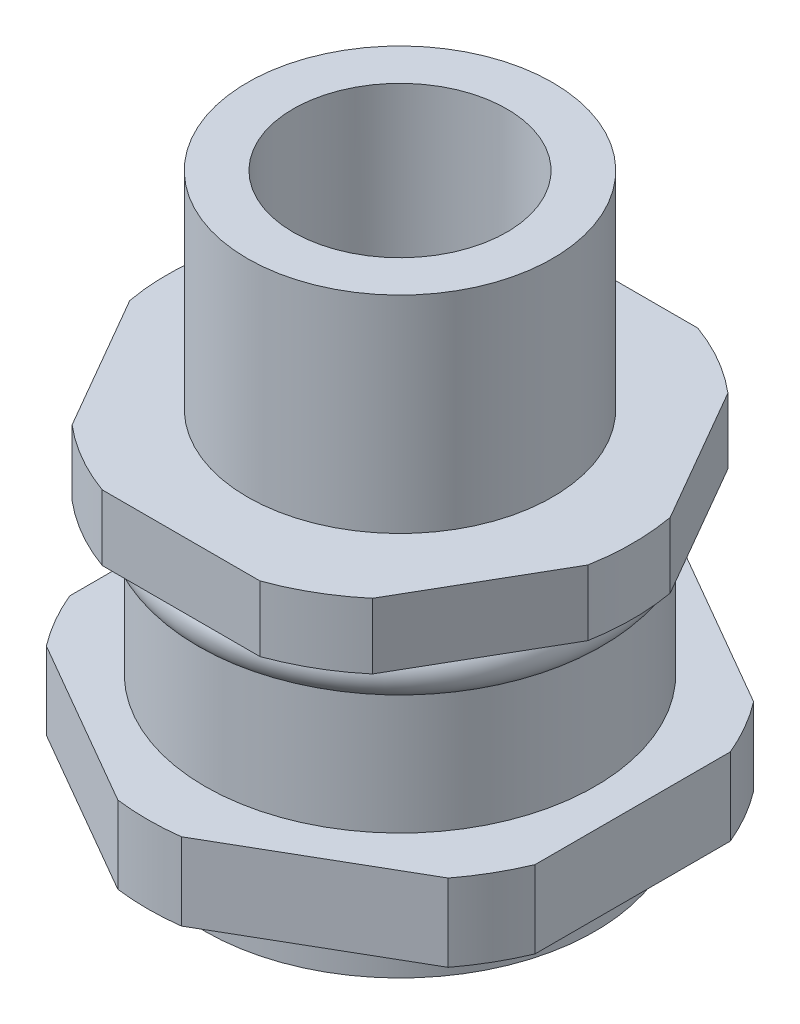
ISO-10303-21;
HEADER;
FILE_DESCRIPTION(('STEP AP214'),'2;1');
FILE_NAME('part.step','',(''),(''),'','','');
FILE_SCHEMA(('AUTOMOTIVE_DESIGN { 1 0 10303 214 1 1 1 1 }'));
ENDSEC;
DATA;
#1=APPLICATION_CONTEXT('core data for automotive mechanical design processes');
#2=APPLICATION_PROTOCOL_DEFINITION('international standard','automotive_design',2000,#1);
#3=PRODUCT_CONTEXT('',#1,'mechanical');
#4=PRODUCT('Part','Part','',(#3));
#5=PRODUCT_RELATED_PRODUCT_CATEGORY('part','',(#4));
#6=PRODUCT_DEFINITION_FORMATION('','',#4);
#7=PRODUCT_DEFINITION_CONTEXT('part definition',#1,'design');
#8=PRODUCT_DEFINITION('design','',#6,#7);
#9=PRODUCT_DEFINITION_SHAPE('','',#8);
#10=(LENGTH_UNIT() NAMED_UNIT(*) SI_UNIT(.MILLI.,.METRE.));
#11=(NAMED_UNIT(*) PLANE_ANGLE_UNIT() SI_UNIT($,.RADIAN.));
#12=(NAMED_UNIT(*) SI_UNIT($,.STERADIAN.) SOLID_ANGLE_UNIT());
#13=UNCERTAINTY_MEASURE_WITH_UNIT(LENGTH_MEASURE(1.E-05),#10,'distance_accuracy_value','');
#14=(GEOMETRIC_REPRESENTATION_CONTEXT(3) GLOBAL_UNCERTAINTY_ASSIGNED_CONTEXT((#13)) GLOBAL_UNIT_ASSIGNED_CONTEXT((#10,
#11,#12)) REPRESENTATION_CONTEXT('',''));
#15=CARTESIAN_POINT('',(0.,0.,0.));
#16=DIRECTION('',(0.,0.,1.));
#17=DIRECTION('',(1.,0.,0.));
#18=AXIS2_PLACEMENT_3D('',#15,#16,#17);
#19=CARTESIAN_POINT('',(0.,-3.429,0.));
#20=DIRECTION('',(0.,1.,0.));
#21=DIRECTION('',(0.,0.,1.));
#22=AXIS2_PLACEMENT_3D('',#19,#20,#21);
#23=TOROIDAL_SURFACE('',#22,7.1882,0.889000000000001);
#24=CARTESIAN_POINT('',(0.,-3.429,8.0772));
#25=VERTEX_POINT('',#24);
#26=VERTEX_LOOP('',#25);
#27=FACE_BOUND('',#26,.T.);
#28=ADVANCED_FACE('F39',(#27),#23,.T.);
#29=CLOSED_SHELL('',(#28));
#30=MANIFOLD_SOLID_BREP('B2',#29);
#31=CARTESIAN_POINT('',(0.,-13.7541,0.));
#32=DIRECTION('',(0.,1.,0.));
#33=DIRECTION('',(0.,0.,1.));
#34=AXIS2_PLACEMENT_3D('',#31,#32,#33);
#35=CYLINDRICAL_SURFACE('',#34,7.5565);
#36=CARTESIAN_POINT('',(0.,-2.54,0.));
#37=DIRECTION('',(0.,-1.,0.));
#38=DIRECTION('',(0.,0.,-1.));
#39=AXIS2_PLACEMENT_3D('',#36,#37,#38);
#40=CIRCLE('',#39,7.5565);
#41=CARTESIAN_POINT('',(0.,-2.54,-7.5565));
#42=VERTEX_POINT('',#41);
#43=EDGE_CURVE('E61',#42,#42,#40,.T.);
#44=ORIENTED_EDGE('',*,*,#43,.T.);
#45=EDGE_LOOP('',(#44));
#46=FACE_BOUND('',#45,.T.);
#47=CARTESIAN_POINT('',(0.,-8.89,0.));
#48=DIRECTION('',(0.,-1.,0.));
#49=DIRECTION('',(0.,0.,-1.));
#50=AXIS2_PLACEMENT_3D('',#47,#48,#49);
#51=CIRCLE('',#50,7.5565);
#52=CARTESIAN_POINT('',(0.,-8.89,-7.5565));
#53=VERTEX_POINT('',#52);
#54=EDGE_CURVE('E37',#53,#53,#51,.T.);
#55=ORIENTED_EDGE('',*,*,#54,.F.);
#56=EDGE_LOOP('',(#55));
#57=FACE_BOUND('',#56,.T.);
#58=ADVANCED_FACE('F52',(#46,#57),#35,.T.);
#59=CARTESIAN_POINT('',(0.,-2.54,0.));
#60=DIRECTION('',(0.,1.,0.));
#61=DIRECTION('',(0.,0.,1.));
#62=AXIS2_PLACEMENT_3D('',#59,#60,#61);
#63=CYLINDRICAL_SURFACE('',#62,9.017);
#64=DIRECTION('',(0.,1.,0.));
#65=VECTOR('',#64,1.);
#66=CARTESIAN_POINT('',(-3.05529377310922,-2.54,-8.4836));
#67=LINE('',#66,#65);
#68=CARTESIAN_POINT('',(-3.05529377310922,-2.54,-8.4836));
#69=VERTEX_POINT('',#68);
#70=CARTESIAN_POINT('',(-3.05529377310922,0.,-8.4836));
#71=VERTEX_POINT('',#70);
#72=EDGE_CURVE('E68',#69,#71,#67,.T.);
#73=ORIENTED_EDGE('',*,*,#72,.F.);
#74=CARTESIAN_POINT('',(0.,-2.54,0.));
#75=DIRECTION('',(0.,-1.,0.));
#76=DIRECTION('',(0.,0.,-1.));
#77=AXIS2_PLACEMENT_3D('',#74,#75,#76);
#78=CIRCLE('',#77,9.017);
#79=CARTESIAN_POINT('',(-5.81936622899106,-2.54,-6.887762023537));
#80=VERTEX_POINT('',#79);
#81=EDGE_CURVE('E313',#80,#69,#78,.T.);
#82=ORIENTED_EDGE('',*,*,#81,.F.);
#83=DIRECTION('',(0.,1.,0.));
#84=VECTOR('',#83,1.);
#85=CARTESIAN_POINT('',(-5.81936622899106,-2.54,-6.887762023537));
#86=LINE('',#85,#84);
#87=CARTESIAN_POINT('',(-5.81936622899106,0.,-6.887762023537));
#88=VERTEX_POINT('',#87);
#89=EDGE_CURVE('E254',#80,#88,#86,.T.);
#90=ORIENTED_EDGE('',*,*,#89,.T.);
#91=CARTESIAN_POINT('',(0.,0.,0.));
#92=DIRECTION('',(0.,-1.,0.));
#93=DIRECTION('',(0.,0.,-1.));
#94=AXIS2_PLACEMENT_3D('',#91,#92,#93);
#95=CIRCLE('',#94,9.017);
#96=EDGE_CURVE('E305',#88,#71,#95,.T.);
#97=ORIENTED_EDGE('',*,*,#96,.T.);
#98=EDGE_LOOP('',(#73,#82,#90,#97));
#99=FACE_BOUND('',#98,.T.);
#100=ADVANCED_FACE('F333',(#99),#63,.T.);
#101=DIRECTION('',(0.,1.,0.));
#102=VECTOR('',#101,1.);
#103=CARTESIAN_POINT('',(3.05529377310922,-2.54,-8.4836));
#104=LINE('',#103,#102);
#105=CARTESIAN_POINT('',(3.05529377310922,-2.54,-8.4836));
#106=VERTEX_POINT('',#105);
#107=CARTESIAN_POINT('',(3.05529377310922,0.,-8.4836));
#108=VERTEX_POINT('',#107);
#109=EDGE_CURVE('E293',#106,#108,#104,.T.);
#110=ORIENTED_EDGE('',*,*,#109,.T.);
#111=CARTESIAN_POINT('',(5.81936622899105,0.,-6.887762023537));
#112=VERTEX_POINT('',#111);
#113=EDGE_CURVE('E314',#108,#112,#95,.T.);
#114=ORIENTED_EDGE('',*,*,#113,.T.);
#115=DIRECTION('',(0.,1.,0.));
#116=VECTOR('',#115,1.);
#117=CARTESIAN_POINT('',(5.81936622899105,-2.54,-6.887762023537));
#118=LINE('',#117,#116);
#119=CARTESIAN_POINT('',(5.81936622899105,-2.54,-6.887762023537));
#120=VERTEX_POINT('',#119);
#121=EDGE_CURVE('E257',#120,#112,#118,.T.);
#122=ORIENTED_EDGE('',*,*,#121,.F.);
#123=EDGE_CURVE('E308',#106,#120,#78,.T.);
#124=ORIENTED_EDGE('',*,*,#123,.F.);
#125=EDGE_LOOP('',(#110,#114,#122,#124));
#126=FACE_BOUND('',#125,.T.);
#127=ADVANCED_FACE('F401',(#126),#63,.T.);
#128=DIRECTION('',(0.,1.,0.));
#129=VECTOR('',#128,1.);
#130=CARTESIAN_POINT('',(8.87466000210027,-2.54,1.59583797646301));
#131=LINE('',#130,#129);
#132=CARTESIAN_POINT('',(8.87466000210027,-2.54,1.59583797646301));
#133=VERTEX_POINT('',#132);
#134=CARTESIAN_POINT('',(8.87466000210027,0.,1.59583797646301));
#135=VERTEX_POINT('',#134);
#136=EDGE_CURVE('E278',#133,#135,#131,.T.);
#137=ORIENTED_EDGE('',*,*,#136,.F.);
#138=CARTESIAN_POINT('',(8.87466000210027,-2.54,-1.595837976463));
#139=VERTEX_POINT('',#138);
#140=EDGE_CURVE('E312',#139,#133,#78,.T.);
#141=ORIENTED_EDGE('',*,*,#140,.F.);
#142=DIRECTION('',(0.,1.,0.));
#143=VECTOR('',#142,1.);
#144=CARTESIAN_POINT('',(8.87466000210027,-2.54,-1.595837976463));
#145=LINE('',#144,#143);
#146=CARTESIAN_POINT('',(8.87466000210027,0.,-1.595837976463));
#147=VERTEX_POINT('',#146);
#148=EDGE_CURVE('E264',#139,#147,#145,.T.);
#149=ORIENTED_EDGE('',*,*,#148,.T.);
#150=EDGE_CURVE('E317',#147,#135,#95,.T.);
#151=ORIENTED_EDGE('',*,*,#150,.T.);
#152=EDGE_LOOP('',(#137,#141,#149,#151));
#153=FACE_BOUND('',#152,.T.);
#154=ADVANCED_FACE('F354',(#153),#63,.T.);
#155=DIRECTION('',(0.,1.,0.));
#156=VECTOR('',#155,1.);
#157=CARTESIAN_POINT('',(5.81936622899105,-2.54,6.887762023537));
#158=LINE('',#157,#156);
#159=CARTESIAN_POINT('',(5.81936622899105,-2.54,6.887762023537));
#160=VERTEX_POINT('',#159);
#161=CARTESIAN_POINT('',(5.81936622899105,0.,6.887762023537));
#162=VERTEX_POINT('',#161);
#163=EDGE_CURVE('E284',#160,#162,#158,.T.);
#164=ORIENTED_EDGE('',*,*,#163,.T.);
#165=CARTESIAN_POINT('',(3.05529377310922,0.,8.4836));
#166=VERTEX_POINT('',#165);
#167=EDGE_CURVE('E342',#162,#166,#95,.T.);
#168=ORIENTED_EDGE('',*,*,#167,.T.);
#169=DIRECTION('',(0.,1.,0.));
#170=VECTOR('',#169,1.);
#171=CARTESIAN_POINT('',(3.05529377310922,-2.54,8.4836));
#172=LINE('',#171,#170);
#173=CARTESIAN_POINT('',(3.05529377310922,-2.54,8.4836));
#174=VERTEX_POINT('',#173);
#175=EDGE_CURVE('E268',#174,#166,#172,.T.);
#176=ORIENTED_EDGE('',*,*,#175,.F.);
#177=EDGE_CURVE('E363',#160,#174,#78,.T.);
#178=ORIENTED_EDGE('',*,*,#177,.F.);
#179=EDGE_LOOP('',(#164,#168,#176,#178));
#180=FACE_BOUND('',#179,.T.);
#181=ADVANCED_FACE('F361',(#180),#63,.T.);
#182=DIRECTION('',(0.,1.,0.));
#183=VECTOR('',#182,1.);
#184=CARTESIAN_POINT('',(-3.05529377310922,-2.54,8.4836));
#185=LINE('',#184,#183);
#186=CARTESIAN_POINT('',(-3.05529377310922,-2.54,8.4836));
#187=VERTEX_POINT('',#186);
#188=CARTESIAN_POINT('',(-3.05529377310922,0.,8.4836));
#189=VERTEX_POINT('',#188);
#190=EDGE_CURVE('E274',#187,#189,#185,.T.);
#191=ORIENTED_EDGE('',*,*,#190,.T.);
#192=CARTESIAN_POINT('',(-5.81936622899105,0.,6.887762023537));
#193=VERTEX_POINT('',#192);
#194=EDGE_CURVE('E338',#189,#193,#95,.T.);
#195=ORIENTED_EDGE('',*,*,#194,.T.);
#196=DIRECTION('',(0.,1.,0.));
#197=VECTOR('',#196,1.);
#198=CARTESIAN_POINT('',(-5.81936622899105,-2.54,6.887762023537));
#199=LINE('',#198,#197);
#200=CARTESIAN_POINT('',(-5.81936622899105,-2.54,6.887762023537));
#201=VERTEX_POINT('',#200);
#202=EDGE_CURVE('E303',#201,#193,#199,.T.);
#203=ORIENTED_EDGE('',*,*,#202,.F.);
#204=EDGE_CURVE('E366',#187,#201,#78,.T.);
#205=ORIENTED_EDGE('',*,*,#204,.F.);
#206=EDGE_LOOP('',(#191,#195,#203,#205));
#207=FACE_BOUND('',#206,.T.);
#208=ADVANCED_FACE('F380',(#207),#63,.T.);
#209=DIRECTION('',(0.,1.,0.));
#210=VECTOR('',#209,1.);
#211=CARTESIAN_POINT('',(-8.87466000210028,-2.54,-1.59583797646301));
#212=LINE('',#211,#210);
#213=CARTESIAN_POINT('',(-8.87466000210028,-2.54,-1.59583797646301));
#214=VERTEX_POINT('',#213);
#215=CARTESIAN_POINT('',(-8.87466000210027,0.,-1.59583797646301));
#216=VERTEX_POINT('',#215);
#217=EDGE_CURVE('E76',#214,#216,#212,.T.);
#218=ORIENTED_EDGE('',*,*,#217,.F.);
#219=CARTESIAN_POINT('',(-8.87466000210028,-2.54,1.595837976463));
#220=VERTEX_POINT('',#219);
#221=EDGE_CURVE('E368',#220,#214,#78,.T.);
#222=ORIENTED_EDGE('',*,*,#221,.F.);
#223=DIRECTION('',(0.,1.,0.));
#224=VECTOR('',#223,1.);
#225=CARTESIAN_POINT('',(-8.87466000210028,-2.54,1.595837976463));
#226=LINE('',#225,#224);
#227=CARTESIAN_POINT('',(-8.87466000210028,0.,1.595837976463));
#228=VERTEX_POINT('',#227);
#229=EDGE_CURVE('E300',#220,#228,#226,.T.);
#230=ORIENTED_EDGE('',*,*,#229,.T.);
#231=EDGE_CURVE('E336',#228,#216,#95,.T.);
#232=ORIENTED_EDGE('',*,*,#231,.T.);
#233=EDGE_LOOP('',(#218,#222,#230,#232));
#234=FACE_BOUND('',#233,.T.);
#235=ADVANCED_FACE('F377',(#234),#63,.T.);
#236=CARTESIAN_POINT('',(0.,-2.54,0.));
#237=DIRECTION('',(0.,-1.,0.));
#238=DIRECTION('',(0.,0.,-1.));
#239=AXIS2_PLACEMENT_3D('',#236,#237,#238);
#240=PLANE('',#239);
#241=ORIENTED_EDGE('',*,*,#43,.F.);
#242=EDGE_LOOP('',(#241));
#243=FACE_BOUND('',#242,.T.);
#244=ORIENTED_EDGE('',*,*,#81,.T.);
#245=DIRECTION('',(-1.,0.,0.));
#246=VECTOR('',#245,1.);
#247=CARTESIAN_POINT('',(0.,-2.54,-8.4836));
#248=LINE('',#247,#246);
#249=EDGE_CURVE('E291',#106,#69,#248,.T.);
#250=ORIENTED_EDGE('',*,*,#249,.F.);
#251=ORIENTED_EDGE('',*,*,#123,.T.);
#252=DIRECTION('',(-0.5,0.,-0.866025403784439));
#253=VECTOR('',#252,1.);
#254=CARTESIAN_POINT('',(7.34701311554566,-2.54,-4.2418));
#255=LINE('',#254,#253);
#256=EDGE_CURVE('E262',#139,#120,#255,.T.);
#257=ORIENTED_EDGE('',*,*,#256,.F.);
#258=ORIENTED_EDGE('',*,*,#140,.T.);
#259=DIRECTION('',(0.500000000000001,0.,-0.866025403784438));
#260=VECTOR('',#259,1.);
#261=CARTESIAN_POINT('',(7.34701311554566,-2.54,4.2418));
#262=LINE('',#261,#260);
#263=EDGE_CURVE('E282',#160,#133,#262,.T.);
#264=ORIENTED_EDGE('',*,*,#263,.F.);
#265=ORIENTED_EDGE('',*,*,#177,.T.);
#266=DIRECTION('',(1.,0.,0.));
#267=VECTOR('',#266,1.);
#268=CARTESIAN_POINT('',(0.,-2.54,8.4836));
#269=LINE('',#268,#267);
#270=EDGE_CURVE('E272',#187,#174,#269,.T.);
#271=ORIENTED_EDGE('',*,*,#270,.F.);
#272=ORIENTED_EDGE('',*,*,#204,.T.);
#273=DIRECTION('',(0.5,0.,0.866025403784439));
#274=VECTOR('',#273,1.);
#275=CARTESIAN_POINT('',(-7.34701311554566,-2.54,4.2418));
#276=LINE('',#275,#274);
#277=EDGE_CURVE('E298',#220,#201,#276,.T.);
#278=ORIENTED_EDGE('',*,*,#277,.F.);
#279=ORIENTED_EDGE('',*,*,#221,.T.);
#280=DIRECTION('',(-0.5,0.,0.866025403784439));
#281=VECTOR('',#280,1.);
#282=CARTESIAN_POINT('',(-7.34701311554566,-2.54,-4.2418));
#283=LINE('',#282,#281);
#284=EDGE_CURVE('E252',#80,#214,#283,.T.);
#285=ORIENTED_EDGE('',*,*,#284,.F.);
#286=EDGE_LOOP('',(#244,#250,#251,#257,#258,#264,#265,#271,#272,#278,#279,#285));
#287=FACE_BOUND('',#286,.T.);
#288=ADVANCED_FACE('F327',(#243,#287),#240,.T.);
#289=CARTESIAN_POINT('',(0.,0.,0.));
#290=DIRECTION('',(0.,-1.,0.));
#291=DIRECTION('',(0.,0.,-1.));
#292=AXIS2_PLACEMENT_3D('',#289,#290,#291);
#293=PLANE('',#292);
#294=CARTESIAN_POINT('',(0.,0.,0.));
#295=DIRECTION('',(0.,1.,0.));
#296=DIRECTION('',(0.,0.,1.));
#297=AXIS2_PLACEMENT_3D('',#294,#295,#296);
#298=CIRCLE('',#297,5.91185);
#299=CARTESIAN_POINT('',(0.,0.,5.91185));
#300=VERTEX_POINT('',#299);
#301=EDGE_CURVE('E311',#300,#300,#298,.T.);
#302=ORIENTED_EDGE('',*,*,#301,.F.);
#303=EDGE_LOOP('',(#302));
#304=FACE_BOUND('',#303,.T.);
#305=DIRECTION('',(-1.,0.,0.));
#306=VECTOR('',#305,1.);
#307=CARTESIAN_POINT('',(0.,0.,-8.4836));
#308=LINE('',#307,#306);
#309=EDGE_CURVE('E248',#108,#71,#308,.T.);
#310=ORIENTED_EDGE('',*,*,#309,.T.);
#311=ORIENTED_EDGE('',*,*,#96,.F.);
#312=DIRECTION('',(-0.5,0.,0.866025403784439));
#313=VECTOR('',#312,1.);
#314=CARTESIAN_POINT('',(-7.34701311554566,0.,-4.2418));
#315=LINE('',#314,#313);
#316=EDGE_CURVE('E255',#88,#216,#315,.T.);
#317=ORIENTED_EDGE('',*,*,#316,.T.);
#318=ORIENTED_EDGE('',*,*,#231,.F.);
#319=DIRECTION('',(0.5,0.,0.866025403784439));
#320=VECTOR('',#319,1.);
#321=CARTESIAN_POINT('',(-7.34701311554566,0.,4.2418));
#322=LINE('',#321,#320);
#323=EDGE_CURVE('E259',#228,#193,#322,.T.);
#324=ORIENTED_EDGE('',*,*,#323,.T.);
#325=ORIENTED_EDGE('',*,*,#194,.F.);
#326=DIRECTION('',(1.,0.,0.));
#327=VECTOR('',#326,1.);
#328=CARTESIAN_POINT('',(0.,0.,8.4836));
#329=LINE('',#328,#327);
#330=EDGE_CURVE('E275',#189,#166,#329,.T.);
#331=ORIENTED_EDGE('',*,*,#330,.T.);
#332=ORIENTED_EDGE('',*,*,#167,.F.);
#333=DIRECTION('',(0.500000000000001,0.,-0.866025403784438));
#334=VECTOR('',#333,1.);
#335=CARTESIAN_POINT('',(7.34701311554566,0.,4.2418));
#336=LINE('',#335,#334);
#337=EDGE_CURVE('E285',#162,#135,#336,.T.);
#338=ORIENTED_EDGE('',*,*,#337,.T.);
#339=ORIENTED_EDGE('',*,*,#150,.F.);
#340=DIRECTION('',(-0.5,0.,-0.866025403784439));
#341=VECTOR('',#340,1.);
#342=CARTESIAN_POINT('',(7.34701311554566,0.,-4.2418));
#343=LINE('',#342,#341);
#344=EDGE_CURVE('E265',#147,#112,#343,.T.);
#345=ORIENTED_EDGE('',*,*,#344,.T.);
#346=ORIENTED_EDGE('',*,*,#113,.F.);
#347=EDGE_LOOP('',(#310,#311,#317,#318,#324,#325,#331,#332,#338,#339,#345,#346));
#348=FACE_BOUND('',#347,.T.);
#349=ADVANCED_FACE('F324',(#304,#348),#293,.F.);
#350=CARTESIAN_POINT('',(0.,8.001,0.));
#351=DIRECTION('',(0.,-1.,0.));
#352=DIRECTION('',(0.,0.,-1.));
#353=AXIS2_PLACEMENT_3D('',#350,#351,#352);
#354=CYLINDRICAL_SURFACE('',#353,5.91185);
#355=CARTESIAN_POINT('',(0.,8.001,0.));
#356=DIRECTION('',(0.,1.,0.));
#357=DIRECTION('',(0.,0.,1.));
#358=AXIS2_PLACEMENT_3D('',#355,#356,#357);
#359=CIRCLE('',#358,5.91185);
#360=CARTESIAN_POINT('',(0.,8.001,5.91185));
#361=VERTEX_POINT('',#360);
#362=EDGE_CURVE('E251',#361,#361,#359,.T.);
#363=ORIENTED_EDGE('',*,*,#362,.F.);
#364=EDGE_LOOP('',(#363));
#365=FACE_BOUND('',#364,.T.);
#366=ORIENTED_EDGE('',*,*,#301,.T.);
#367=EDGE_LOOP('',(#366));
#368=FACE_BOUND('',#367,.T.);
#369=ADVANCED_FACE('F54',(#365,#368),#354,.T.);
#370=CARTESIAN_POINT('',(0.,8.001,0.));
#371=DIRECTION('',(0.,1.,0.));
#372=DIRECTION('',(0.,0.,1.));
#373=AXIS2_PLACEMENT_3D('',#370,#371,#372);
#374=PLANE('',#373);
#375=CARTESIAN_POINT('',(0.,8.001,0.));
#376=DIRECTION('',(0.,1.,0.));
#377=DIRECTION('',(0.,0.,1.));
#378=AXIS2_PLACEMENT_3D('',#375,#376,#377);
#379=CIRCLE('',#378,4.1402);
#380=CARTESIAN_POINT('',(0.,8.001,4.1402));
#381=VERTEX_POINT('',#380);
#382=EDGE_CURVE('E496',#381,#381,#379,.T.);
#383=ORIENTED_EDGE('',*,*,#382,.F.);
#384=EDGE_LOOP('',(#383));
#385=FACE_BOUND('',#384,.T.);
#386=ORIENTED_EDGE('',*,*,#362,.T.);
#387=EDGE_LOOP('',(#386));
#388=FACE_BOUND('',#387,.T.);
#389=ADVANCED_FACE('F484',(#385,#388),#374,.T.);
#390=CARTESIAN_POINT('',(-7.34701311554566,-2.54,4.2418));
#391=DIRECTION('',(-0.866025403784439,0.,0.5));
#392=DIRECTION('',(0.5,0.,0.866025403784439));
#393=AXIS2_PLACEMENT_3D('',#390,#391,#392);
#394=PLANE('',#393);
#395=ORIENTED_EDGE('',*,*,#323,.F.);
#396=ORIENTED_EDGE('',*,*,#229,.F.);
#397=ORIENTED_EDGE('',*,*,#277,.T.);
#398=ORIENTED_EDGE('',*,*,#202,.T.);
#399=EDGE_LOOP('',(#395,#396,#397,#398));
#400=FACE_BOUND('',#399,.T.);
#401=ADVANCED_FACE('F379',(#400),#394,.T.);
#402=CARTESIAN_POINT('',(-7.34701311554566,-2.54,-4.2418));
#403=DIRECTION('',(-0.866025403784438,0.,-0.5));
#404=DIRECTION('',(-0.5,0.,0.866025403784439));
#405=AXIS2_PLACEMENT_3D('',#402,#403,#404);
#406=PLANE('',#405);
#407=ORIENTED_EDGE('',*,*,#316,.F.);
#408=ORIENTED_EDGE('',*,*,#89,.F.);
#409=ORIENTED_EDGE('',*,*,#284,.T.);
#410=ORIENTED_EDGE('',*,*,#217,.T.);
#411=EDGE_LOOP('',(#407,#408,#409,#410));
#412=FACE_BOUND('',#411,.T.);
#413=ADVANCED_FACE('F376',(#412),#406,.T.);
#414=CARTESIAN_POINT('',(7.34701311554566,-2.54,-4.2418));
#415=DIRECTION('',(0.866025403784439,0.,-0.5));
#416=DIRECTION('',(-0.5,0.,-0.866025403784439));
#417=AXIS2_PLACEMENT_3D('',#414,#415,#416);
#418=PLANE('',#417);
#419=ORIENTED_EDGE('',*,*,#344,.F.);
#420=ORIENTED_EDGE('',*,*,#148,.F.);
#421=ORIENTED_EDGE('',*,*,#256,.T.);
#422=ORIENTED_EDGE('',*,*,#121,.T.);
#423=EDGE_LOOP('',(#419,#420,#421,#422));
#424=FACE_BOUND('',#423,.T.);
#425=ADVANCED_FACE('F384',(#424),#418,.T.);
#426=CARTESIAN_POINT('',(0.,-2.54,8.4836));
#427=DIRECTION('',(0.,0.,1.));
#428=DIRECTION('',(1.,0.,0.));
#429=AXIS2_PLACEMENT_3D('',#426,#427,#428);
#430=PLANE('',#429);
#431=ORIENTED_EDGE('',*,*,#330,.F.);
#432=ORIENTED_EDGE('',*,*,#190,.F.);
#433=ORIENTED_EDGE('',*,*,#270,.T.);
#434=ORIENTED_EDGE('',*,*,#175,.T.);
#435=EDGE_LOOP('',(#431,#432,#433,#434));
#436=FACE_BOUND('',#435,.T.);
#437=ADVANCED_FACE('F382',(#436),#430,.T.);
#438=CARTESIAN_POINT('',(7.34701311554566,-2.54,4.2418));
#439=DIRECTION('',(0.866025403784438,0.,0.500000000000001));
#440=DIRECTION('',(0.500000000000001,0.,-0.866025403784438));
#441=AXIS2_PLACEMENT_3D('',#438,#439,#440);
#442=PLANE('',#441);
#443=ORIENTED_EDGE('',*,*,#337,.F.);
#444=ORIENTED_EDGE('',*,*,#163,.F.);
#445=ORIENTED_EDGE('',*,*,#263,.T.);
#446=ORIENTED_EDGE('',*,*,#136,.T.);
#447=EDGE_LOOP('',(#443,#444,#445,#446));
#448=FACE_BOUND('',#447,.T.);
#449=ADVANCED_FACE('F358',(#448),#442,.T.);
#450=CARTESIAN_POINT('',(0.,-2.54,-8.4836));
#451=DIRECTION('',(0.,0.,-1.));
#452=DIRECTION('',(-1.,0.,0.));
#453=AXIS2_PLACEMENT_3D('',#450,#451,#452);
#454=PLANE('',#453);
#455=ORIENTED_EDGE('',*,*,#309,.F.);
#456=ORIENTED_EDGE('',*,*,#109,.F.);
#457=ORIENTED_EDGE('',*,*,#249,.T.);
#458=ORIENTED_EDGE('',*,*,#72,.T.);
#459=EDGE_LOOP('',(#455,#456,#457,#458));
#460=FACE_BOUND('',#459,.T.);
#461=ADVANCED_FACE('F390',(#460),#454,.T.);
#462=CARTESIAN_POINT('',(0.,-11.8872,0.));
#463=DIRECTION('',(0.,1.,0.));
#464=DIRECTION('',(0.,0.,1.));
#465=AXIS2_PLACEMENT_3D('',#462,#463,#464);
#466=CYLINDRICAL_SURFACE('',#465,9.779);
#467=CARTESIAN_POINT('',(0.,-8.89,0.));
#468=DIRECTION('',(0.,-1.,0.));
#469=DIRECTION('',(0.,0.,-1.));
#470=AXIS2_PLACEMENT_3D('',#467,#468,#469);
#471=CIRCLE('',#470,9.779);
#472=CARTESIAN_POINT('',(-9.017,-8.89,-3.78451476414085));
#473=VERTEX_POINT('',#472);
#474=CARTESIAN_POINT('',(-7.78598592674325,-8.89,-5.91669368385385));
#475=VERTEX_POINT('',#474);
#476=EDGE_CURVE('E238',#473,#475,#471,.T.);
#477=ORIENTED_EDGE('',*,*,#476,.T.);
#478=DIRECTION('',(0.,1.,0.));
#479=VECTOR('',#478,1.);
#480=CARTESIAN_POINT('',(-7.78598592674325,-11.8872,-5.91669368385385));
#481=LINE('',#480,#479);
#482=CARTESIAN_POINT('',(-7.78598592674325,-11.8872,-5.91669368385385));
#483=VERTEX_POINT('',#482);
#484=EDGE_CURVE('E218',#483,#475,#481,.T.);
#485=ORIENTED_EDGE('',*,*,#484,.F.);
#486=CARTESIAN_POINT('',(0.,-11.8872,0.));
#487=DIRECTION('',(0.,-1.,0.));
#488=DIRECTION('',(0.,0.,-1.));
#489=AXIS2_PLACEMENT_3D('',#486,#487,#488);
#490=CIRCLE('',#489,9.779);
#491=CARTESIAN_POINT('',(-9.017,-11.8872,-3.78451476414085));
#492=VERTEX_POINT('',#491);
#493=EDGE_CURVE('E225',#492,#483,#490,.T.);
#494=ORIENTED_EDGE('',*,*,#493,.F.);
#495=DIRECTION('',(0.,1.,0.));
#496=VECTOR('',#495,1.);
#497=CARTESIAN_POINT('',(-9.017,-11.8872,-3.78451476414085));
#498=LINE('',#497,#496);
#499=EDGE_CURVE('E522',#492,#473,#498,.T.);
#500=ORIENTED_EDGE('',*,*,#499,.T.);
#501=EDGE_LOOP('',(#477,#485,#494,#500));
#502=FACE_BOUND('',#501,.T.);
#503=ADVANCED_FACE('F236',(#502),#466,.T.);
#504=CARTESIAN_POINT('',(-7.78598592674325,-11.8872,-5.91669368385385));
#505=DIRECTION('',(0.5,0.,0.866025403784438));
#506=DIRECTION('',(0.866025403784438,0.,-0.5));
#507=AXIS2_PLACEMENT_3D('',#504,#505,#506);
#508=PLANE('',#507);
#509=DIRECTION('',(0.866025403784438,0.,-0.5));
#510=VECTOR('',#509,1.);
#511=CARTESIAN_POINT('',(-7.78598592674325,-8.89,-5.91669368385385));
#512=LINE('',#511,#510);
#513=CARTESIAN_POINT('',(-1.23101407325675,-8.89,-9.7012084479947));
#514=VERTEX_POINT('',#513);
#515=EDGE_CURVE('E524',#475,#514,#512,.T.);
#516=ORIENTED_EDGE('',*,*,#515,.T.);
#517=DIRECTION('',(0.,1.,0.));
#518=VECTOR('',#517,1.);
#519=CARTESIAN_POINT('',(-1.23101407325675,-11.8872,-9.7012084479947));
#520=LINE('',#519,#518);
#521=CARTESIAN_POINT('',(-1.23101407325675,-11.8872,-9.7012084479947));
#522=VERTEX_POINT('',#521);
#523=EDGE_CURVE('E221',#522,#514,#520,.T.);
#524=ORIENTED_EDGE('',*,*,#523,.F.);
#525=DIRECTION('',(0.866025403784438,0.,-0.5));
#526=VECTOR('',#525,1.);
#527=CARTESIAN_POINT('',(-7.78598592674325,-11.8872,-5.91669368385385));
#528=LINE('',#527,#526);
#529=EDGE_CURVE('E214',#483,#522,#528,.T.);
#530=ORIENTED_EDGE('',*,*,#529,.F.);
#531=ORIENTED_EDGE('',*,*,#484,.T.);
#532=EDGE_LOOP('',(#516,#524,#530,#531));
#533=FACE_BOUND('',#532,.T.);
#534=ADVANCED_FACE('F216',(#533),#508,.F.);
#535=CARTESIAN_POINT('',(0.,-11.8872,0.));
#536=DIRECTION('',(0.,1.,0.));
#537=DIRECTION('',(0.,0.,1.));
#538=AXIS2_PLACEMENT_3D('',#535,#536,#537);
#539=CYLINDRICAL_SURFACE('',#538,9.779);
#540=CARTESIAN_POINT('',(0.,-8.89,0.));
#541=DIRECTION('',(0.,-1.,0.));
#542=DIRECTION('',(0.,0.,-1.));
#543=AXIS2_PLACEMENT_3D('',#540,#541,#542);
#544=CIRCLE('',#543,9.779);
#545=CARTESIAN_POINT('',(1.23101407325675,-8.89,-9.7012084479947));
#546=VERTEX_POINT('',#545);
#547=EDGE_CURVE('E526',#514,#546,#544,.T.);
#548=ORIENTED_EDGE('',*,*,#547,.T.);
#549=DIRECTION('',(0.,1.,0.));
#550=VECTOR('',#549,1.);
#551=CARTESIAN_POINT('',(1.23101407325675,-11.8872,-9.7012084479947));
#552=LINE('',#551,#550);
#553=CARTESIAN_POINT('',(1.23101407325675,-11.8872,-9.7012084479947));
#554=VERTEX_POINT('',#553);
#555=EDGE_CURVE('E242',#554,#546,#552,.T.);
#556=ORIENTED_EDGE('',*,*,#555,.F.);
#557=CARTESIAN_POINT('',(0.,-11.8872,0.));
#558=DIRECTION('',(0.,-1.,0.));
#559=DIRECTION('',(0.,0.,-1.));
#560=AXIS2_PLACEMENT_3D('',#557,#558,#559);
#561=CIRCLE('',#560,9.779);
#562=EDGE_CURVE('E224',#522,#554,#561,.T.);
#563=ORIENTED_EDGE('',*,*,#562,.F.);
#564=ORIENTED_EDGE('',*,*,#523,.T.);
#565=EDGE_LOOP('',(#548,#556,#563,#564));
#566=FACE_BOUND('',#565,.T.);
#567=ADVANCED_FACE('F467',(#566),#539,.T.);
#568=CARTESIAN_POINT('',(1.23101407325675,-11.8872,-9.70120844799471));
#569=DIRECTION('',(-0.5,0.,0.866025403784438));
#570=DIRECTION('',(0.866025403784439,0.,0.5));
#571=AXIS2_PLACEMENT_3D('',#568,#569,#570);
#572=PLANE('',#571);
#573=DIRECTION('',(0.866025403784438,0.,0.5));
#574=VECTOR('',#573,1.);
#575=CARTESIAN_POINT('',(1.23101407325675,-8.89,-9.70120844799471));
#576=LINE('',#575,#574);
#577=CARTESIAN_POINT('',(7.78598592674325,-8.89,-5.91669368385385));
#578=VERTEX_POINT('',#577);
#579=EDGE_CURVE('E528',#546,#578,#576,.T.);
#580=ORIENTED_EDGE('',*,*,#579,.T.);
#581=DIRECTION('',(0.,1.,0.));
#582=VECTOR('',#581,1.);
#583=CARTESIAN_POINT('',(7.78598592674325,-11.8872,-5.91669368385385));
#584=LINE('',#583,#582);
#585=CARTESIAN_POINT('',(7.78598592674325,-11.8872,-5.91669368385385));
#586=VERTEX_POINT('',#585);
#587=EDGE_CURVE('E567',#586,#578,#584,.T.);
#588=ORIENTED_EDGE('',*,*,#587,.F.);
#589=DIRECTION('',(0.866025403784438,0.,0.5));
#590=VECTOR('',#589,1.);
#591=CARTESIAN_POINT('',(1.23101407325675,-11.8872,-9.70120844799471));
#592=LINE('',#591,#590);
#593=EDGE_CURVE('E505',#554,#586,#592,.T.);
#594=ORIENTED_EDGE('',*,*,#593,.F.);
#595=ORIENTED_EDGE('',*,*,#555,.T.);
#596=EDGE_LOOP('',(#580,#588,#594,#595));
#597=FACE_BOUND('',#596,.T.);
#598=ADVANCED_FACE('F463',(#597),#572,.F.);
#599=CARTESIAN_POINT('',(0.,-11.8872,0.));
#600=DIRECTION('',(0.,1.,0.));
#601=DIRECTION('',(0.,0.,1.));
#602=AXIS2_PLACEMENT_3D('',#599,#600,#601);
#603=CYLINDRICAL_SURFACE('',#602,9.779);
#604=CARTESIAN_POINT('',(0.,-8.89,0.));
#605=DIRECTION('',(0.,-1.,0.));
#606=DIRECTION('',(0.,0.,-1.));
#607=AXIS2_PLACEMENT_3D('',#604,#605,#606);
#608=CIRCLE('',#607,9.779);
#609=CARTESIAN_POINT('',(9.017,-8.89,-3.78451476414085));
#610=VERTEX_POINT('',#609);
#611=EDGE_CURVE('E530',#578,#610,#608,.T.);
#612=ORIENTED_EDGE('',*,*,#611,.T.);
#613=DIRECTION('',(0.,1.,0.));
#614=VECTOR('',#613,1.);
#615=CARTESIAN_POINT('',(9.017,-11.8872,-3.78451476414085));
#616=LINE('',#615,#614);
#617=CARTESIAN_POINT('',(9.017,-11.8872,-3.78451476414085));
#618=VERTEX_POINT('',#617);
#619=EDGE_CURVE('E564',#618,#610,#616,.T.);
#620=ORIENTED_EDGE('',*,*,#619,.F.);
#621=CARTESIAN_POINT('',(0.,-11.8872,0.));
#622=DIRECTION('',(0.,-1.,0.));
#623=DIRECTION('',(0.,0.,-1.));
#624=AXIS2_PLACEMENT_3D('',#621,#622,#623);
#625=CIRCLE('',#624,9.779);
#626=EDGE_CURVE('E507',#586,#618,#625,.T.);
#627=ORIENTED_EDGE('',*,*,#626,.F.);
#628=ORIENTED_EDGE('',*,*,#587,.T.);
#629=EDGE_LOOP('',(#612,#620,#627,#628));
#630=FACE_BOUND('',#629,.T.);
#631=ADVANCED_FACE('F459',(#630),#603,.T.);
#632=CARTESIAN_POINT('',(9.017,-11.8872,-3.78451476414085));
#633=DIRECTION('',(-1.,0.,0.));
#634=DIRECTION('',(0.,0.,1.));
#635=AXIS2_PLACEMENT_3D('',#632,#633,#634);
#636=PLANE('',#635);
#637=DIRECTION('',(0.,0.,1.));
#638=VECTOR('',#637,1.);
#639=CARTESIAN_POINT('',(9.017,-8.89,-3.78451476414085));
#640=LINE('',#639,#638);
#641=CARTESIAN_POINT('',(9.017,-8.89,3.78451476414085));
#642=VERTEX_POINT('',#641);
#643=EDGE_CURVE('E532',#610,#642,#640,.T.);
#644=ORIENTED_EDGE('',*,*,#643,.T.);
#645=DIRECTION('',(0.,1.,0.));
#646=VECTOR('',#645,1.);
#647=CARTESIAN_POINT('',(9.017,-11.8872,3.78451476414085));
#648=LINE('',#647,#646);
#649=CARTESIAN_POINT('',(9.017,-11.8872,3.78451476414085));
#650=VERTEX_POINT('',#649);
#651=EDGE_CURVE('E561',#650,#642,#648,.T.);
#652=ORIENTED_EDGE('',*,*,#651,.F.);
#653=DIRECTION('',(0.,0.,1.));
#654=VECTOR('',#653,1.);
#655=CARTESIAN_POINT('',(9.017,-11.8872,-3.78451476414085));
#656=LINE('',#655,#654);
#657=EDGE_CURVE('E509',#618,#650,#656,.T.);
#658=ORIENTED_EDGE('',*,*,#657,.F.);
#659=ORIENTED_EDGE('',*,*,#619,.T.);
#660=EDGE_LOOP('',(#644,#652,#658,#659));
#661=FACE_BOUND('',#660,.T.);
#662=ADVANCED_FACE('F455',(#661),#636,.F.);
#663=CARTESIAN_POINT('',(0.,-11.8872,0.));
#664=DIRECTION('',(0.,1.,0.));
#665=DIRECTION('',(0.,0.,1.));
#666=AXIS2_PLACEMENT_3D('',#663,#664,#665);
#667=CYLINDRICAL_SURFACE('',#666,9.779);
#668=CARTESIAN_POINT('',(0.,-8.89,0.));
#669=DIRECTION('',(0.,-1.,0.));
#670=DIRECTION('',(0.,0.,-1.));
#671=AXIS2_PLACEMENT_3D('',#668,#669,#670);
#672=CIRCLE('',#671,9.779);
#673=CARTESIAN_POINT('',(7.78598592674324,-8.89,5.91669368385386));
#674=VERTEX_POINT('',#673);
#675=EDGE_CURVE('E534',#642,#674,#672,.T.);
#676=ORIENTED_EDGE('',*,*,#675,.T.);
#677=DIRECTION('',(0.,1.,0.));
#678=VECTOR('',#677,1.);
#679=CARTESIAN_POINT('',(7.78598592674324,-11.8872,5.91669368385386));
#680=LINE('',#679,#678);
#681=CARTESIAN_POINT('',(7.78598592674324,-11.8872,5.91669368385386));
#682=VERTEX_POINT('',#681);
#683=EDGE_CURVE('E558',#682,#674,#680,.T.);
#684=ORIENTED_EDGE('',*,*,#683,.F.);
#685=CARTESIAN_POINT('',(0.,-11.8872,0.));
#686=DIRECTION('',(0.,-1.,0.));
#687=DIRECTION('',(0.,0.,-1.));
#688=AXIS2_PLACEMENT_3D('',#685,#686,#687);
#689=CIRCLE('',#688,9.779);
#690=EDGE_CURVE('E511',#650,#682,#689,.T.);
#691=ORIENTED_EDGE('',*,*,#690,.F.);
#692=ORIENTED_EDGE('',*,*,#651,.T.);
#693=EDGE_LOOP('',(#676,#684,#691,#692));
#694=FACE_BOUND('',#693,.T.);
#695=ADVANCED_FACE('F451',(#694),#667,.T.);
#696=CARTESIAN_POINT('',(7.78598592674324,-11.8872,5.91669368385386));
#697=DIRECTION('',(-0.5,0.,-0.866025403784439));
#698=DIRECTION('',(-0.866025403784439,0.,0.5));
#699=AXIS2_PLACEMENT_3D('',#696,#697,#698);
#700=PLANE('',#699);
#701=DIRECTION('',(-0.866025403784438,0.,0.5));
#702=VECTOR('',#701,1.);
#703=CARTESIAN_POINT('',(7.78598592674324,-8.89,5.91669368385386));
#704=LINE('',#703,#702);
#705=CARTESIAN_POINT('',(1.23101407325675,-8.89,9.7012084479947));
#706=VERTEX_POINT('',#705);
#707=EDGE_CURVE('E536',#674,#706,#704,.T.);
#708=ORIENTED_EDGE('',*,*,#707,.T.);
#709=DIRECTION('',(0.,1.,0.));
#710=VECTOR('',#709,1.);
#711=CARTESIAN_POINT('',(1.23101407325675,-11.8872,9.7012084479947));
#712=LINE('',#711,#710);
#713=CARTESIAN_POINT('',(1.23101407325675,-11.8872,9.7012084479947));
#714=VERTEX_POINT('',#713);
#715=EDGE_CURVE('E555',#714,#706,#712,.T.);
#716=ORIENTED_EDGE('',*,*,#715,.F.);
#717=DIRECTION('',(-0.866025403784438,0.,0.5));
#718=VECTOR('',#717,1.);
#719=CARTESIAN_POINT('',(7.78598592674324,-11.8872,5.91669368385386));
#720=LINE('',#719,#718);
#721=EDGE_CURVE('E513',#682,#714,#720,.T.);
#722=ORIENTED_EDGE('',*,*,#721,.F.);
#723=ORIENTED_EDGE('',*,*,#683,.T.);
#724=EDGE_LOOP('',(#708,#716,#722,#723));
#725=FACE_BOUND('',#724,.T.);
#726=ADVANCED_FACE('F447',(#725),#700,.F.);
#727=CARTESIAN_POINT('',(0.,-11.8872,0.));
#728=DIRECTION('',(0.,1.,0.));
#729=DIRECTION('',(0.,0.,1.));
#730=AXIS2_PLACEMENT_3D('',#727,#728,#729);
#731=CYLINDRICAL_SURFACE('',#730,9.779);
#732=CARTESIAN_POINT('',(0.,-8.89,0.));
#733=DIRECTION('',(0.,-1.,0.));
#734=DIRECTION('',(0.,0.,-1.));
#735=AXIS2_PLACEMENT_3D('',#732,#733,#734);
#736=CIRCLE('',#735,9.779);
#737=CARTESIAN_POINT('',(-1.23101407325675,-8.89,9.70120844799471));
#738=VERTEX_POINT('',#737);
#739=EDGE_CURVE('E538',#706,#738,#736,.T.);
#740=ORIENTED_EDGE('',*,*,#739,.T.);
#741=DIRECTION('',(0.,1.,0.));
#742=VECTOR('',#741,1.);
#743=CARTESIAN_POINT('',(-1.23101407325675,-11.8872,9.70120844799471));
#744=LINE('',#743,#742);
#745=CARTESIAN_POINT('',(-1.23101407325675,-11.8872,9.70120844799471));
#746=VERTEX_POINT('',#745);
#747=EDGE_CURVE('E552',#746,#738,#744,.T.);
#748=ORIENTED_EDGE('',*,*,#747,.F.);
#749=CARTESIAN_POINT('',(0.,-11.8872,0.));
#750=DIRECTION('',(0.,-1.,0.));
#751=DIRECTION('',(0.,0.,-1.));
#752=AXIS2_PLACEMENT_3D('',#749,#750,#751);
#753=CIRCLE('',#752,9.779);
#754=EDGE_CURVE('E515',#714,#746,#753,.T.);
#755=ORIENTED_EDGE('',*,*,#754,.F.);
#756=ORIENTED_EDGE('',*,*,#715,.T.);
#757=EDGE_LOOP('',(#740,#748,#755,#756));
#758=FACE_BOUND('',#757,.T.);
#759=ADVANCED_FACE('F443',(#758),#731,.T.);
#760=CARTESIAN_POINT('',(-1.23101407325675,-11.8872,9.7012084479947));
#761=DIRECTION('',(0.5,0.,-0.866025403784439));
#762=DIRECTION('',(-0.866025403784439,0.,-0.5));
#763=AXIS2_PLACEMENT_3D('',#760,#761,#762);
#764=PLANE('',#763);
#765=DIRECTION('',(-0.866025403784439,0.,-0.5));
#766=VECTOR('',#765,1.);
#767=CARTESIAN_POINT('',(-1.23101407325675,-8.89,9.7012084479947));
#768=LINE('',#767,#766);
#769=CARTESIAN_POINT('',(-7.78598592674324,-8.89,5.91669368385386));
#770=VERTEX_POINT('',#769);
#771=EDGE_CURVE('E540',#738,#770,#768,.T.);
#772=ORIENTED_EDGE('',*,*,#771,.T.);
#773=DIRECTION('',(0.,1.,0.));
#774=VECTOR('',#773,1.);
#775=CARTESIAN_POINT('',(-7.78598592674324,-11.8872,5.91669368385386));
#776=LINE('',#775,#774);
#777=CARTESIAN_POINT('',(-7.78598592674324,-11.8872,5.91669368385386));
#778=VERTEX_POINT('',#777);
#779=EDGE_CURVE('E549',#778,#770,#776,.T.);
#780=ORIENTED_EDGE('',*,*,#779,.F.);
#781=DIRECTION('',(-0.866025403784439,0.,-0.5));
#782=VECTOR('',#781,1.);
#783=CARTESIAN_POINT('',(-1.23101407325675,-11.8872,9.7012084479947));
#784=LINE('',#783,#782);
#785=EDGE_CURVE('E517',#746,#778,#784,.T.);
#786=ORIENTED_EDGE('',*,*,#785,.F.);
#787=ORIENTED_EDGE('',*,*,#747,.T.);
#788=EDGE_LOOP('',(#772,#780,#786,#787));
#789=FACE_BOUND('',#788,.T.);
#790=ADVANCED_FACE('F439',(#789),#764,.F.);
#791=CARTESIAN_POINT('',(0.,-11.8872,0.));
#792=DIRECTION('',(0.,1.,0.));
#793=DIRECTION('',(0.,0.,1.));
#794=AXIS2_PLACEMENT_3D('',#791,#792,#793);
#795=CYLINDRICAL_SURFACE('',#794,9.779);
#796=CARTESIAN_POINT('',(0.,-8.89,0.));
#797=DIRECTION('',(0.,-1.,0.));
#798=DIRECTION('',(0.,0.,-1.));
#799=AXIS2_PLACEMENT_3D('',#796,#797,#798);
#800=CIRCLE('',#799,9.779);
#801=CARTESIAN_POINT('',(-9.017,-8.89,3.78451476414085));
#802=VERTEX_POINT('',#801);
#803=EDGE_CURVE('E542',#770,#802,#800,.T.);
#804=ORIENTED_EDGE('',*,*,#803,.T.);
#805=DIRECTION('',(0.,1.,0.));
#806=VECTOR('',#805,1.);
#807=CARTESIAN_POINT('',(-9.017,-11.8872,3.78451476414085));
#808=LINE('',#807,#806);
#809=CARTESIAN_POINT('',(-9.017,-11.8872,3.78451476414085));
#810=VERTEX_POINT('',#809);
#811=EDGE_CURVE('E546',#810,#802,#808,.T.);
#812=ORIENTED_EDGE('',*,*,#811,.F.);
#813=CARTESIAN_POINT('',(0.,-11.8872,0.));
#814=DIRECTION('',(0.,-1.,0.));
#815=DIRECTION('',(0.,0.,-1.));
#816=AXIS2_PLACEMENT_3D('',#813,#814,#815);
#817=CIRCLE('',#816,9.779);
#818=EDGE_CURVE('E519',#778,#810,#817,.T.);
#819=ORIENTED_EDGE('',*,*,#818,.F.);
#820=ORIENTED_EDGE('',*,*,#779,.T.);
#821=EDGE_LOOP('',(#804,#812,#819,#820));
#822=FACE_BOUND('',#821,.T.);
#823=ADVANCED_FACE('F432',(#822),#795,.T.);
#824=CARTESIAN_POINT('',(-9.017,-11.8872,3.78451476414085));
#825=DIRECTION('',(1.,0.,0.));
#826=DIRECTION('',(0.,0.,-1.));
#827=AXIS2_PLACEMENT_3D('',#824,#825,#826);
#828=PLANE('',#827);
#829=DIRECTION('',(0.,0.,-1.));
#830=VECTOR('',#829,1.);
#831=CARTESIAN_POINT('',(-9.017,-8.89,3.78451476414085));
#832=LINE('',#831,#830);
#833=EDGE_CURVE('E234',#802,#473,#832,.T.);
#834=ORIENTED_EDGE('',*,*,#833,.T.);
#835=ORIENTED_EDGE('',*,*,#499,.F.);
#836=DIRECTION('',(0.,0.,-1.));
#837=VECTOR('',#836,1.);
#838=CARTESIAN_POINT('',(-9.017,-11.8872,3.78451476414085));
#839=LINE('',#838,#837);
#840=EDGE_CURVE('E230',#810,#492,#839,.T.);
#841=ORIENTED_EDGE('',*,*,#840,.F.);
#842=ORIENTED_EDGE('',*,*,#811,.T.);
#843=EDGE_LOOP('',(#834,#835,#841,#842));
#844=FACE_BOUND('',#843,.T.);
#845=ADVANCED_FACE('F424',(#844),#828,.F.);
#846=CARTESIAN_POINT('',(0.,-11.8872,0.));
#847=DIRECTION('',(0.,-1.,0.));
#848=DIRECTION('',(0.,0.,-1.));
#849=AXIS2_PLACEMENT_3D('',#846,#847,#848);
#850=PLANE('',#849);
#851=CARTESIAN_POINT('',(0.,-11.8872,0.));
#852=DIRECTION('',(0.,-1.,0.));
#853=DIRECTION('',(0.,0.,-1.));
#854=AXIS2_PLACEMENT_3D('',#851,#852,#853);
#855=CIRCLE('',#854,7.5565);
#856=CARTESIAN_POINT('',(0.,-11.8872,-7.5565));
#857=VERTEX_POINT('',#856);
#858=EDGE_CURVE('E56',#857,#857,#855,.T.);
#859=ORIENTED_EDGE('',*,*,#858,.F.);
#860=EDGE_LOOP('',(#859));
#861=FACE_BOUND('',#860,.T.);
#862=ORIENTED_EDGE('',*,*,#493,.T.);
#863=ORIENTED_EDGE('',*,*,#529,.T.);
#864=ORIENTED_EDGE('',*,*,#562,.T.);
#865=ORIENTED_EDGE('',*,*,#593,.T.);
#866=ORIENTED_EDGE('',*,*,#626,.T.);
#867=ORIENTED_EDGE('',*,*,#657,.T.);
#868=ORIENTED_EDGE('',*,*,#690,.T.);
#869=ORIENTED_EDGE('',*,*,#721,.T.);
#870=ORIENTED_EDGE('',*,*,#754,.T.);
#871=ORIENTED_EDGE('',*,*,#785,.T.);
#872=ORIENTED_EDGE('',*,*,#818,.T.);
#873=ORIENTED_EDGE('',*,*,#840,.T.);
#874=EDGE_LOOP('',(#862,#863,#864,#865,#866,#867,#868,#869,#870,#871,#872,#873));
#875=FACE_BOUND('',#874,.T.);
#876=ADVANCED_FACE('F228',(#861,#875),#850,.T.);
#877=CARTESIAN_POINT('',(0.,-8.89,0.));
#878=DIRECTION('',(0.,-1.,0.));
#879=DIRECTION('',(0.,0.,-1.));
#880=AXIS2_PLACEMENT_3D('',#877,#878,#879);
#881=PLANE('',#880);
#882=ORIENTED_EDGE('',*,*,#54,.T.);
#883=EDGE_LOOP('',(#882));
#884=FACE_BOUND('',#883,.T.);
#885=ORIENTED_EDGE('',*,*,#476,.F.);
#886=ORIENTED_EDGE('',*,*,#833,.F.);
#887=ORIENTED_EDGE('',*,*,#803,.F.);
#888=ORIENTED_EDGE('',*,*,#771,.F.);
#889=ORIENTED_EDGE('',*,*,#739,.F.);
#890=ORIENTED_EDGE('',*,*,#707,.F.);
#891=ORIENTED_EDGE('',*,*,#675,.F.);
#892=ORIENTED_EDGE('',*,*,#643,.F.);
#893=ORIENTED_EDGE('',*,*,#611,.F.);
#894=ORIENTED_EDGE('',*,*,#579,.F.);
#895=ORIENTED_EDGE('',*,*,#547,.F.);
#896=ORIENTED_EDGE('',*,*,#515,.F.);
#897=EDGE_LOOP('',(#885,#886,#887,#888,#889,#890,#891,#892,#893,#894,#895,#896));
#898=FACE_BOUND('',#897,.T.);
#899=ADVANCED_FACE('F417',(#884,#898),#881,.F.);
#900=CARTESIAN_POINT('',(0.,-13.7541,0.));
#901=DIRECTION('',(0.,-1.,0.));
#902=DIRECTION('',(0.,0.,-1.));
#903=AXIS2_PLACEMENT_3D('',#900,#901,#902);
#904=PLANE('',#903);
#905=CARTESIAN_POINT('',(0.,-13.7541,0.));
#906=DIRECTION('',(0.,-1.,0.));
#907=DIRECTION('',(0.,0.,-1.));
#908=AXIS2_PLACEMENT_3D('',#905,#906,#907);
#909=CIRCLE('',#908,7.5565);
#910=CARTESIAN_POINT('',(0.,-13.7541,-7.5565));
#911=VERTEX_POINT('',#910);
#912=EDGE_CURVE('E241',#911,#911,#909,.T.);
#913=ORIENTED_EDGE('',*,*,#912,.T.);
#914=EDGE_LOOP('',(#913));
#915=FACE_BOUND('',#914,.T.);
#916=ADVANCED_FACE('F408',(#915),#904,.T.);
#917=ORIENTED_EDGE('',*,*,#858,.T.);
#918=EDGE_LOOP('',(#917));
#919=FACE_BOUND('',#918,.T.);
#920=ORIENTED_EDGE('',*,*,#912,.F.);
#921=EDGE_LOOP('',(#920));
#922=FACE_BOUND('',#921,.T.);
#923=ADVANCED_FACE('F397',(#919,#922),#35,.T.);
#924=CARTESIAN_POINT('',(0.,0.,0.));
#925=DIRECTION('',(0.,-1.,0.));
#926=DIRECTION('',(0.,0.,-1.));
#927=AXIS2_PLACEMENT_3D('',#924,#925,#926);
#928=PLANE('',#927);
#929=CARTESIAN_POINT('',(0.,0.,0.));
#930=DIRECTION('',(0.,-1.,0.));
#931=DIRECTION('',(0.,0.,-1.));
#932=AXIS2_PLACEMENT_3D('',#929,#930,#931);
#933=CIRCLE('',#932,4.1402);
#934=CARTESIAN_POINT('',(0.,0.,-4.1402));
#935=VERTEX_POINT('',#934);
#936=EDGE_CURVE('E499',#935,#935,#933,.F.);
#937=ORIENTED_EDGE('',*,*,#936,.T.);
#938=EDGE_LOOP('',(#937));
#939=FACE_BOUND('',#938,.T.);
#940=ADVANCED_FACE('F407',(#939),#928,.F.);
#941=CARTESIAN_POINT('',(0.,-11.7102539818742,0.));
#942=DIRECTION('',(0.,1.,0.));
#943=DIRECTION('',(0.,0.,1.));
#944=AXIS2_PLACEMENT_3D('',#941,#942,#943);
#945=CYLINDRICAL_SURFACE('',#944,4.1402);
#946=ORIENTED_EDGE('',*,*,#382,.T.);
#947=EDGE_LOOP('',(#946));
#948=FACE_BOUND('',#947,.T.);
#949=ORIENTED_EDGE('',*,*,#936,.F.);
#950=EDGE_LOOP('',(#949));
#951=FACE_BOUND('',#950,.T.);
#952=ADVANCED_FACE('F414',(#948,#951),#945,.F.);
#953=CLOSED_SHELL('',(#58,#100,#127,#154,#181,#208,#235,#288,#349,#369,#389,#401,#413,#425,#437,
#449,#461,#503,#534,#567,#598,#631,#662,#695,#726,#759,#790,#823,#845,#876,#899,#916,#923,#940,#952));
#954=MANIFOLD_SOLID_BREP('B6',#953);
#955=ADVANCED_BREP_SHAPE_REPRESENTATION('',(#18,#30,#954),#14);
#956=SHAPE_DEFINITION_REPRESENTATION(#9,#955);
ENDSEC;
END-ISO-10303-21;
